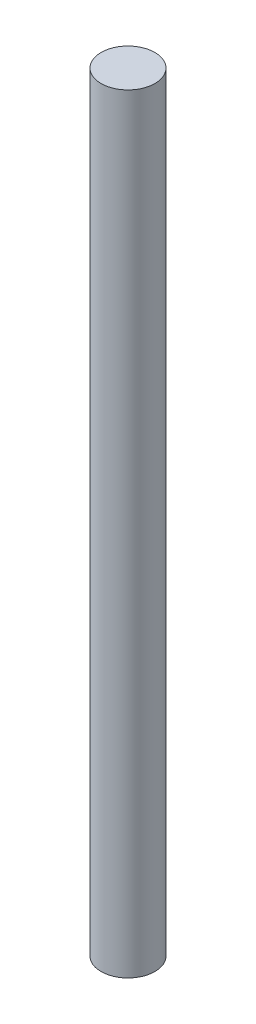
ISO-10303-21;
HEADER;
FILE_DESCRIPTION(('STEP AP214'),'2;1');
FILE_NAME('part.step','',(''),(''),'','','');
FILE_SCHEMA(('AUTOMOTIVE_DESIGN { 1 0 10303 214 1 1 1 1 }'));
ENDSEC;
DATA;
#1=APPLICATION_CONTEXT('core data for automotive mechanical design processes');
#2=APPLICATION_PROTOCOL_DEFINITION('international standard','automotive_design',2000,#1);
#3=PRODUCT_CONTEXT('',#1,'mechanical');
#4=PRODUCT('Part','Part','',(#3));
#5=PRODUCT_RELATED_PRODUCT_CATEGORY('part','',(#4));
#6=PRODUCT_DEFINITION_FORMATION('','',#4);
#7=PRODUCT_DEFINITION_CONTEXT('part definition',#1,'design');
#8=PRODUCT_DEFINITION('design','',#6,#7);
#9=PRODUCT_DEFINITION_SHAPE('','',#8);
#10=(LENGTH_UNIT() NAMED_UNIT(*) SI_UNIT(.MILLI.,.METRE.));
#11=(NAMED_UNIT(*) PLANE_ANGLE_UNIT() SI_UNIT($,.RADIAN.));
#12=(NAMED_UNIT(*) SI_UNIT($,.STERADIAN.) SOLID_ANGLE_UNIT());
#13=UNCERTAINTY_MEASURE_WITH_UNIT(LENGTH_MEASURE(1.E-05),#10,'distance_accuracy_value','');
#14=(GEOMETRIC_REPRESENTATION_CONTEXT(3) GLOBAL_UNCERTAINTY_ASSIGNED_CONTEXT((#13)) GLOBAL_UNIT_ASSIGNED_CONTEXT((#10,
#11,#12)) REPRESENTATION_CONTEXT('',''));
#15=CARTESIAN_POINT('',(0.,0.,0.));
#16=DIRECTION('',(0.,0.,1.));
#17=DIRECTION('',(1.,0.,0.));
#18=AXIS2_PLACEMENT_3D('',#15,#16,#17);
#19=CARTESIAN_POINT('',(-0.7,-20.,0.));
#20=DIRECTION('',(0.,-1.,0.));
#21=DIRECTION('',(0.,0.,-1.));
#22=AXIS2_PLACEMENT_3D('',#19,#20,#21);
#23=PLANE('',#22);
#24=CARTESIAN_POINT('',(0.7,-20.,0.));
#25=DIRECTION('',(0.,1.,0.));
#26=DIRECTION('',(0.,0.,1.));
#27=AXIS2_PLACEMENT_3D('',#24,#25,#26);
#28=CIRCLE('',#27,1.4);
#29=CARTESIAN_POINT('',(0.7,-20.,1.4));
#30=VERTEX_POINT('',#29);
#31=EDGE_CURVE('E10',#30,#30,#28,.T.);
#32=ORIENTED_EDGE('',*,*,#31,.F.);
#33=EDGE_LOOP('',(#32));
#34=FACE_BOUND('',#33,.T.);
#35=ADVANCED_FACE('F32',(#34),#23,.T.);
#36=CARTESIAN_POINT('',(0.7,20.,0.));
#37=DIRECTION('',(0.,1.,0.));
#38=DIRECTION('',(0.,0.,1.));
#39=AXIS2_PLACEMENT_3D('',#36,#37,#38);
#40=CYLINDRICAL_SURFACE('',#39,1.4);
#41=ORIENTED_EDGE('',*,*,#31,.T.);
#42=EDGE_LOOP('',(#41));
#43=FACE_BOUND('',#42,.T.);
#44=CARTESIAN_POINT('',(0.7,20.,0.));
#45=DIRECTION('',(0.,1.,0.));
#46=DIRECTION('',(0.,0.,1.));
#47=AXIS2_PLACEMENT_3D('',#44,#45,#46);
#48=CIRCLE('',#47,1.4);
#49=CARTESIAN_POINT('',(0.7,20.,1.4));
#50=VERTEX_POINT('',#49);
#51=EDGE_CURVE('E38',#50,#50,#48,.T.);
#52=ORIENTED_EDGE('',*,*,#51,.F.);
#53=EDGE_LOOP('',(#52));
#54=FACE_BOUND('',#53,.T.);
#55=ADVANCED_FACE('F46',(#43,#54),#40,.T.);
#56=CARTESIAN_POINT('',(-0.7,20.,0.));
#57=DIRECTION('',(0.,1.,0.));
#58=DIRECTION('',(0.,0.,1.));
#59=AXIS2_PLACEMENT_3D('',#56,#57,#58);
#60=PLANE('',#59);
#61=ORIENTED_EDGE('',*,*,#51,.T.);
#62=EDGE_LOOP('',(#61));
#63=FACE_BOUND('',#62,.T.);
#64=ADVANCED_FACE('F44',(#63),#60,.T.);
#65=CLOSED_SHELL('',(#35,#55,#64));
#66=MANIFOLD_SOLID_BREP('B2',#65);
#67=ADVANCED_BREP_SHAPE_REPRESENTATION('',(#18,#66),#14);
#68=SHAPE_DEFINITION_REPRESENTATION(#9,#67);
ENDSEC;
END-ISO-10303-21;
